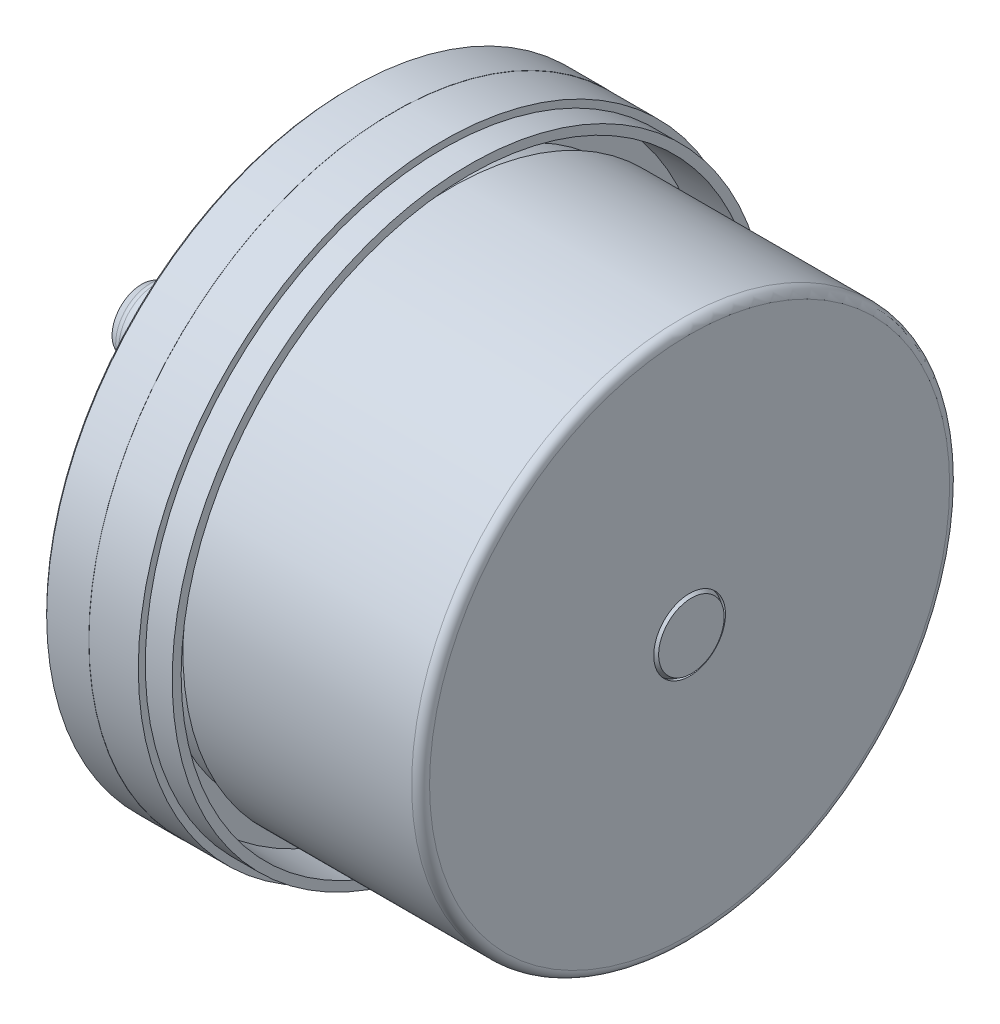
ISO-10303-21;
HEADER;
FILE_DESCRIPTION(('STEP AP214'),'2;1');
FILE_NAME('part.step','',(''),(''),'','','');
FILE_SCHEMA(('AUTOMOTIVE_DESIGN { 1 0 10303 214 1 1 1 1 }'));
ENDSEC;
DATA;
#1=APPLICATION_CONTEXT('core data for automotive mechanical design processes');
#2=APPLICATION_PROTOCOL_DEFINITION('international standard','automotive_design',2000,#1);
#3=PRODUCT_CONTEXT('',#1,'mechanical');
#4=PRODUCT('Part','Part','',(#3));
#5=PRODUCT_RELATED_PRODUCT_CATEGORY('part','',(#4));
#6=PRODUCT_DEFINITION_FORMATION('','',#4);
#7=PRODUCT_DEFINITION_CONTEXT('part definition',#1,'design');
#8=PRODUCT_DEFINITION('design','',#6,#7);
#9=PRODUCT_DEFINITION_SHAPE('','',#8);
#10=(LENGTH_UNIT() NAMED_UNIT(*) SI_UNIT(.MILLI.,.METRE.));
#11=(NAMED_UNIT(*) PLANE_ANGLE_UNIT() SI_UNIT($,.RADIAN.));
#12=(NAMED_UNIT(*) SI_UNIT($,.STERADIAN.) SOLID_ANGLE_UNIT());
#13=UNCERTAINTY_MEASURE_WITH_UNIT(LENGTH_MEASURE(1.E-05),#10,'distance_accuracy_value','');
#14=(GEOMETRIC_REPRESENTATION_CONTEXT(3) GLOBAL_UNCERTAINTY_ASSIGNED_CONTEXT((#13)) GLOBAL_UNIT_ASSIGNED_CONTEXT((#10,
#11,#12)) REPRESENTATION_CONTEXT('',''));
#15=CARTESIAN_POINT('',(0.,0.,0.));
#16=DIRECTION('',(0.,0.,1.));
#17=DIRECTION('',(1.,0.,0.));
#18=AXIS2_PLACEMENT_3D('',#15,#16,#17);
#19=CARTESIAN_POINT('',(-21.8999999999602,-8.96647078790032E-12,0.));
#20=DIRECTION('',(1.,0.,0.));
#21=DIRECTION('',(0.,0.,-1.));
#22=AXIS2_PLACEMENT_3D('',#19,#20,#21);
#23=CONICAL_SURFACE('',#22,4.00000000000897,0.523598775598299);
#24=CARTESIAN_POINT('',(-22.1320508075291,-8.96647078790032E-12,0.));
#25=DIRECTION('',(-1.,0.,0.));
#26=DIRECTION('',(0.,0.,1.));
#27=AXIS2_PLACEMENT_3D('',#24,#25,#26);
#28=CIRCLE('',#27,3.86602540379341);
#29=CARTESIAN_POINT('',(-22.1320508075291,-8.96647078790032E-12,3.86602540379341));
#30=VERTEX_POINT('',#29);
#31=EDGE_CURVE('E11',#30,#30,#28,.T.);
#32=ORIENTED_EDGE('',*,*,#31,.T.);
#33=EDGE_LOOP('',(#32));
#34=FACE_BOUND('',#33,.T.);
#35=CARTESIAN_POINT('',(-23.0999999999374,-8.96647078790032E-12,0.));
#36=DIRECTION('',(1.,0.,0.));
#37=DIRECTION('',(0.,0.,-1.));
#38=AXIS2_PLACEMENT_3D('',#35,#36,#37);
#39=CIRCLE('',#38,3.30717967699457);
#40=CARTESIAN_POINT('',(-23.0999999999374,-8.96647078790032E-12,-3.30717967699457));
#41=VERTEX_POINT('',#40);
#42=EDGE_CURVE('E121',#41,#41,#39,.T.);
#43=ORIENTED_EDGE('',*,*,#42,.T.);
#44=EDGE_LOOP('',(#43));
#45=FACE_BOUND('',#44,.T.);
#46=ADVANCED_FACE('F34',(#34,#45),#23,.T.);
#47=CARTESIAN_POINT('',(-23.0999999999374,3.3071796769856,0.));
#48=DIRECTION('',(-1.,0.,0.));
#49=DIRECTION('',(0.,0.,1.));
#50=AXIS2_PLACEMENT_3D('',#47,#48,#49);
#51=PLANE('',#50);
#52=ORIENTED_EDGE('',*,*,#42,.F.);
#53=EDGE_LOOP('',(#52));
#54=FACE_BOUND('',#53,.T.);
#55=ADVANCED_FACE('F175',(#54),#51,.T.);
#56=CARTESIAN_POINT('',(38.2000000000212,-8.96647078790032E-12,0.));
#57=DIRECTION('',(1.,0.,0.));
#58=DIRECTION('',(0.,0.,-1.));
#59=AXIS2_PLACEMENT_3D('',#56,#57,#58);
#60=PLANE('',#59);
#61=CARTESIAN_POINT('',(38.2000000000212,-8.96647078790032E-12,0.));
#62=DIRECTION('',(1.,0.,0.));
#63=DIRECTION('',(0.,0.,-1.));
#64=AXIS2_PLACEMENT_3D('',#61,#62,#63);
#65=CIRCLE('',#64,3.65358983848293);
#66=CARTESIAN_POINT('',(38.2000000000212,-8.96647078790032E-12,-3.65358983848293));
#67=VERTEX_POINT('',#66);
#68=EDGE_CURVE('E118',#67,#67,#65,.T.);
#69=ORIENTED_EDGE('',*,*,#68,.T.);
#70=EDGE_LOOP('',(#69));
#71=FACE_BOUND('',#70,.T.);
#72=ADVANCED_FACE('F181',(#71),#60,.T.);
#73=CARTESIAN_POINT('',(38.2000000000212,-8.96647078790032E-12,0.));
#74=DIRECTION('',(-1.,0.,0.));
#75=DIRECTION('',(0.,0.,1.));
#76=AXIS2_PLACEMENT_3D('',#73,#74,#75);
#77=CONICAL_SURFACE('',#76,3.65358983848293,0.52359877559829);
#78=CARTESIAN_POINT('',(37.6,-8.96647078790032E-12,0.));
#79=DIRECTION('',(1.,0.,0.));
#80=DIRECTION('',(0.,0.,-1.));
#81=AXIS2_PLACEMENT_3D('',#78,#79,#80);
#82=CIRCLE('',#81,4.00000000000897);
#83=CARTESIAN_POINT('',(37.6,-8.96647078790032E-12,-4.00000000000897));
#84=VERTEX_POINT('',#83);
#85=EDGE_CURVE('E115',#84,#84,#82,.T.);
#86=ORIENTED_EDGE('',*,*,#85,.T.);
#87=EDGE_LOOP('',(#86));
#88=FACE_BOUND('',#87,.T.);
#89=ORIENTED_EDGE('',*,*,#68,.F.);
#90=EDGE_LOOP('',(#89));
#91=FACE_BOUND('',#90,.T.);
#92=ADVANCED_FACE('F283',(#88,#91),#77,.T.);
#93=CARTESIAN_POINT('',(-23.0999999999374,-8.96647078790032E-12,0.));
#94=DIRECTION('',(1.,0.,0.));
#95=DIRECTION('',(0.,0.,-1.));
#96=AXIS2_PLACEMENT_3D('',#93,#94,#95);
#97=CYLINDRICAL_SURFACE('',#96,4.00000000000897);
#98=CARTESIAN_POINT('',(38.,-8.96647078790032E-12,0.));
#99=DIRECTION('',(1.,0.,0.));
#100=DIRECTION('',(0.,0.,-1.));
#101=AXIS2_PLACEMENT_3D('',#98,#99,#100);
#102=CIRCLE('',#101,4.00000000000897);
#103=CARTESIAN_POINT('',(38.,-8.96647078790032E-12,-4.00000000000897));
#104=VERTEX_POINT('',#103);
#105=EDGE_CURVE('E112',#104,#104,#102,.T.);
#106=ORIENTED_EDGE('',*,*,#105,.T.);
#107=EDGE_LOOP('',(#106));
#108=FACE_BOUND('',#107,.T.);
#109=ORIENTED_EDGE('',*,*,#85,.F.);
#110=EDGE_LOOP('',(#109));
#111=FACE_BOUND('',#110,.T.);
#112=ADVANCED_FACE('F279',(#108,#111),#97,.F.);
#113=CARTESIAN_POINT('',(38.,4.,0.));
#114=DIRECTION('',(1.,0.,0.));
#115=DIRECTION('',(0.,0.,-1.));
#116=AXIS2_PLACEMENT_3D('',#113,#114,#115);
#117=PLANE('',#116);
#118=CARTESIAN_POINT('',(38.,-8.96647078790032E-12,0.));
#119=DIRECTION('',(1.,0.,0.));
#120=DIRECTION('',(0.,0.,-1.));
#121=AXIS2_PLACEMENT_3D('',#118,#119,#120);
#122=CIRCLE('',#121,29.000000000007);
#123=CARTESIAN_POINT('',(38.,-8.96647078790032E-12,-29.000000000007));
#124=VERTEX_POINT('',#123);
#125=EDGE_CURVE('E154',#124,#124,#122,.T.);
#126=ORIENTED_EDGE('',*,*,#125,.T.);
#127=EDGE_LOOP('',(#126));
#128=FACE_BOUND('',#127,.T.);
#129=ORIENTED_EDGE('',*,*,#105,.F.);
#130=EDGE_LOOP('',(#129));
#131=FACE_BOUND('',#130,.T.);
#132=ADVANCED_FACE('F275',(#128,#131),#117,.T.);
#133=CARTESIAN_POINT('',(-23.0999999999374,-8.96647078790032E-12,0.));
#134=DIRECTION('',(1.,0.,0.));
#135=DIRECTION('',(0.,0.,-1.));
#136=AXIS2_PLACEMENT_3D('',#133,#134,#135);
#137=CYLINDRICAL_SURFACE('',#136,30.000000000007);
#138=CARTESIAN_POINT('',(37.,-8.96647078790032E-12,0.));
#139=DIRECTION('',(1.,0.,0.));
#140=DIRECTION('',(0.,0.,-1.));
#141=AXIS2_PLACEMENT_3D('',#138,#139,#140);
#142=CIRCLE('',#141,30.000000000007);
#143=CARTESIAN_POINT('',(37.,-8.96647078790032E-12,-30.000000000007));
#144=VERTEX_POINT('',#143);
#145=EDGE_CURVE('E157',#144,#144,#142,.F.);
#146=ORIENTED_EDGE('',*,*,#145,.T.);
#147=EDGE_LOOP('',(#146));
#148=FACE_BOUND('',#147,.T.);
#149=CARTESIAN_POINT('',(11.5000000000033,-8.96647078790032E-12,0.));
#150=DIRECTION('',(1.,0.,0.));
#151=DIRECTION('',(0.,0.,-1.));
#152=AXIS2_PLACEMENT_3D('',#149,#150,#151);
#153=CIRCLE('',#152,30.000000000007);
#154=CARTESIAN_POINT('',(11.5000000000033,-8.96647078790032E-12,-30.000000000007));
#155=VERTEX_POINT('',#154);
#156=EDGE_CURVE('E109',#155,#155,#153,.T.);
#157=ORIENTED_EDGE('',*,*,#156,.T.);
#158=EDGE_LOOP('',(#157));
#159=FACE_BOUND('',#158,.T.);
#160=ADVANCED_FACE('F271',(#148,#159),#137,.T.);
#161=CARTESIAN_POINT('',(11.5000000000033,29.9999999999981,0.));
#162=DIRECTION('',(-1.,0.,0.));
#163=DIRECTION('',(0.,0.,1.));
#164=AXIS2_PLACEMENT_3D('',#161,#162,#163);
#165=PLANE('',#164);
#166=CARTESIAN_POINT('',(11.5000000000033,-8.96647078790032E-12,0.));
#167=DIRECTION('',(1.,0.,0.));
#168=DIRECTION('',(0.,0.,-1.));
#169=AXIS2_PLACEMENT_3D('',#166,#167,#168);
#170=CIRCLE('',#169,29.000000000007);
#171=CARTESIAN_POINT('',(11.5000000000033,-8.96647078790032E-12,-29.000000000007));
#172=VERTEX_POINT('',#171);
#173=EDGE_CURVE('E106',#172,#172,#170,.T.);
#174=ORIENTED_EDGE('',*,*,#173,.T.);
#175=EDGE_LOOP('',(#174));
#176=FACE_BOUND('',#175,.T.);
#177=ORIENTED_EDGE('',*,*,#156,.F.);
#178=EDGE_LOOP('',(#177));
#179=FACE_BOUND('',#178,.T.);
#180=ADVANCED_FACE('F267',(#176,#179),#165,.T.);
#181=CARTESIAN_POINT('',(-23.0999999999374,-8.96647078790032E-12,0.));
#182=DIRECTION('',(1.,0.,0.));
#183=DIRECTION('',(0.,0.,-1.));
#184=AXIS2_PLACEMENT_3D('',#181,#182,#183);
#185=CYLINDRICAL_SURFACE('',#184,29.000000000007);
#186=CARTESIAN_POINT('',(7.80000000000329,-8.96647078790032E-12,0.));
#187=DIRECTION('',(1.,0.,0.));
#188=DIRECTION('',(0.,0.,-1.));
#189=AXIS2_PLACEMENT_3D('',#186,#187,#188);
#190=CIRCLE('',#189,29.000000000007);
#191=CARTESIAN_POINT('',(7.80000000000329,-8.96647078790032E-12,-29.000000000007));
#192=VERTEX_POINT('',#191);
#193=EDGE_CURVE('E103',#192,#192,#190,.T.);
#194=ORIENTED_EDGE('',*,*,#193,.T.);
#195=EDGE_LOOP('',(#194));
#196=FACE_BOUND('',#195,.T.);
#197=ORIENTED_EDGE('',*,*,#173,.F.);
#198=EDGE_LOOP('',(#197));
#199=FACE_BOUND('',#198,.T.);
#200=ADVANCED_FACE('F263',(#196,#199),#185,.T.);
#201=CARTESIAN_POINT('',(7.80000000000329,28.9999999999981,0.));
#202=DIRECTION('',(1.,0.,0.));
#203=DIRECTION('',(0.,0.,-1.));
#204=AXIS2_PLACEMENT_3D('',#201,#202,#203);
#205=PLANE('',#204);
#206=CARTESIAN_POINT('',(7.80000000000329,-8.96647078790032E-12,0.));
#207=DIRECTION('',(1.,0.,0.));
#208=DIRECTION('',(0.,0.,-1.));
#209=AXIS2_PLACEMENT_3D('',#206,#207,#208);
#210=CIRCLE('',#209,32.0009516139056);
#211=CARTESIAN_POINT('',(7.80000000000329,-8.96647078790032E-12,-32.0009516139056));
#212=VERTEX_POINT('',#211);
#213=EDGE_CURVE('E100',#212,#212,#210,.T.);
#214=ORIENTED_EDGE('',*,*,#213,.T.);
#215=EDGE_LOOP('',(#214));
#216=FACE_BOUND('',#215,.T.);
#217=ORIENTED_EDGE('',*,*,#193,.F.);
#218=EDGE_LOOP('',(#217));
#219=FACE_BOUND('',#218,.T.);
#220=ADVANCED_FACE('F259',(#216,#219),#205,.T.);
#221=CARTESIAN_POINT('',(7.80000000000329,-8.96647078790032E-12,0.));
#222=DIRECTION('',(1.,0.,0.));
#223=DIRECTION('',(0.,0.,-1.));
#224=AXIS2_PLACEMENT_3D('',#221,#222,#223);
#225=CONICAL_SURFACE('',#224,32.0009516139056,0.0349065850398798);
#226=CARTESIAN_POINT('',(13.5000000000032,-8.96647078790032E-12,0.));
#227=DIRECTION('',(1.,0.,0.));
#228=DIRECTION('',(0.,0.,-1.));
#229=AXIS2_PLACEMENT_3D('',#226,#227,#228);
#230=CIRCLE('',#229,32.2000000000085);
#231=CARTESIAN_POINT('',(13.5000000000032,-8.96647078790032E-12,-32.2000000000085));
#232=VERTEX_POINT('',#231);
#233=EDGE_CURVE('E97',#232,#232,#230,.T.);
#234=ORIENTED_EDGE('',*,*,#233,.T.);
#235=EDGE_LOOP('',(#234));
#236=FACE_BOUND('',#235,.T.);
#237=ORIENTED_EDGE('',*,*,#213,.F.);
#238=EDGE_LOOP('',(#237));
#239=FACE_BOUND('',#238,.T.);
#240=ADVANCED_FACE('F255',(#236,#239),#225,.F.);
#241=CARTESIAN_POINT('',(13.5000000000032,32.1999999999995,0.));
#242=DIRECTION('',(1.,0.,0.));
#243=DIRECTION('',(0.,0.,-1.));
#244=AXIS2_PLACEMENT_3D('',#241,#242,#243);
#245=PLANE('',#244);
#246=CARTESIAN_POINT('',(13.5000000000032,-8.96647078790032E-12,0.));
#247=DIRECTION('',(1.,0.,0.));
#248=DIRECTION('',(0.,0.,-1.));
#249=AXIS2_PLACEMENT_3D('',#246,#247,#248);
#250=CIRCLE('',#249,33.200000000007);
#251=CARTESIAN_POINT('',(13.5000000000032,-8.96647078790032E-12,-33.200000000007));
#252=VERTEX_POINT('',#251);
#253=EDGE_CURVE('E94',#252,#252,#250,.T.);
#254=ORIENTED_EDGE('',*,*,#253,.T.);
#255=EDGE_LOOP('',(#254));
#256=FACE_BOUND('',#255,.T.);
#257=ORIENTED_EDGE('',*,*,#233,.F.);
#258=EDGE_LOOP('',(#257));
#259=FACE_BOUND('',#258,.T.);
#260=ADVANCED_FACE('F251',(#256,#259),#245,.T.);
#261=CARTESIAN_POINT('',(-23.0999999999374,-8.96647078790032E-12,0.));
#262=DIRECTION('',(1.,0.,0.));
#263=DIRECTION('',(0.,0.,-1.));
#264=AXIS2_PLACEMENT_3D('',#261,#262,#263);
#265=CYLINDRICAL_SURFACE('',#264,33.200000000007);
#266=CARTESIAN_POINT('',(10.5000000000032,-8.96647078790032E-12,0.));
#267=DIRECTION('',(1.,0.,0.));
#268=DIRECTION('',(0.,0.,-1.));
#269=AXIS2_PLACEMENT_3D('',#266,#267,#268);
#270=CIRCLE('',#269,33.2000000000071);
#271=CARTESIAN_POINT('',(10.5000000000032,-8.96647078790032E-12,-33.2000000000071));
#272=VERTEX_POINT('',#271);
#273=EDGE_CURVE('E91',#272,#272,#270,.T.);
#274=ORIENTED_EDGE('',*,*,#273,.T.);
#275=EDGE_LOOP('',(#274));
#276=FACE_BOUND('',#275,.T.);
#277=ORIENTED_EDGE('',*,*,#253,.F.);
#278=EDGE_LOOP('',(#277));
#279=FACE_BOUND('',#278,.T.);
#280=ADVANCED_FACE('F247',(#276,#279),#265,.T.);
#281=CARTESIAN_POINT('',(10.5000000000032,33.1999999999981,0.));
#282=DIRECTION('',(1.,0.,0.));
#283=DIRECTION('',(0.,0.,-1.));
#284=AXIS2_PLACEMENT_3D('',#281,#282,#283);
#285=PLANE('',#284);
#286=CARTESIAN_POINT('',(10.5000000000032,-8.96647078790032E-12,0.));
#287=DIRECTION('',(1.,0.,0.));
#288=DIRECTION('',(0.,0.,-1.));
#289=AXIS2_PLACEMENT_3D('',#286,#287,#288);
#290=CIRCLE('',#289,33.980000000007);
#291=CARTESIAN_POINT('',(10.5000000000032,-8.96647078790032E-12,-33.980000000007));
#292=VERTEX_POINT('',#291);
#293=EDGE_CURVE('E88',#292,#292,#290,.T.);
#294=ORIENTED_EDGE('',*,*,#293,.T.);
#295=EDGE_LOOP('',(#294));
#296=FACE_BOUND('',#295,.T.);
#297=ORIENTED_EDGE('',*,*,#273,.F.);
#298=EDGE_LOOP('',(#297));
#299=FACE_BOUND('',#298,.T.);
#300=ADVANCED_FACE('F243',(#296,#299),#285,.T.);
#301=CARTESIAN_POINT('',(-23.0999999999374,-8.96647078790032E-12,0.));
#302=DIRECTION('',(1.,0.,0.));
#303=DIRECTION('',(0.,0.,-1.));
#304=AXIS2_PLACEMENT_3D('',#301,#302,#303);
#305=CYLINDRICAL_SURFACE('',#304,33.980000000007);
#306=CARTESIAN_POINT('',(5.00000000000322,-8.96647078790032E-12,0.));
#307=DIRECTION('',(1.,0.,0.));
#308=DIRECTION('',(0.,0.,-1.));
#309=AXIS2_PLACEMENT_3D('',#306,#307,#308);
#310=CIRCLE('',#309,33.980000000007);
#311=CARTESIAN_POINT('',(5.00000000000322,-8.96647078790032E-12,-33.980000000007));
#312=VERTEX_POINT('',#311);
#313=EDGE_CURVE('E85',#312,#312,#310,.T.);
#314=ORIENTED_EDGE('',*,*,#313,.T.);
#315=EDGE_LOOP('',(#314));
#316=FACE_BOUND('',#315,.T.);
#317=ORIENTED_EDGE('',*,*,#293,.F.);
#318=EDGE_LOOP('',(#317));
#319=FACE_BOUND('',#318,.T.);
#320=ADVANCED_FACE('F239',(#316,#319),#305,.T.);
#321=CARTESIAN_POINT('',(5.00000000000322,33.9799999999981,0.));
#322=DIRECTION('',(1.,0.,0.));
#323=DIRECTION('',(0.,0.,-1.));
#324=AXIS2_PLACEMENT_3D('',#321,#322,#323);
#325=PLANE('',#324);
#326=CARTESIAN_POINT('',(5.00000000000322,-8.96647078790032E-12,0.));
#327=DIRECTION('',(1.,0.,0.));
#328=DIRECTION('',(0.,0.,-1.));
#329=AXIS2_PLACEMENT_3D('',#326,#327,#328);
#330=CIRCLE('',#329,34.000000000007);
#331=CARTESIAN_POINT('',(5.00000000000322,-8.96647078790032E-12,-34.000000000007));
#332=VERTEX_POINT('',#331);
#333=EDGE_CURVE('E82',#332,#332,#330,.T.);
#334=ORIENTED_EDGE('',*,*,#333,.T.);
#335=EDGE_LOOP('',(#334));
#336=FACE_BOUND('',#335,.T.);
#337=ORIENTED_EDGE('',*,*,#313,.F.);
#338=EDGE_LOOP('',(#337));
#339=FACE_BOUND('',#338,.T.);
#340=ADVANCED_FACE('F232',(#336,#339),#325,.T.);
#341=CARTESIAN_POINT('',(-23.0999999999374,-8.96647078790032E-12,0.));
#342=DIRECTION('',(1.,0.,0.));
#343=DIRECTION('',(0.,0.,-1.));
#344=AXIS2_PLACEMENT_3D('',#341,#342,#343);
#345=CYLINDRICAL_SURFACE('',#344,34.000000000007);
#346=CARTESIAN_POINT('',(0.300000000003332,-8.96647078790032E-12,0.));
#347=DIRECTION('',(-1.,0.,0.));
#348=DIRECTION('',(0.,0.,1.));
#349=AXIS2_PLACEMENT_3D('',#346,#347,#348);
#350=CIRCLE('',#349,34.000000000007);
#351=CARTESIAN_POINT('',(0.300000000003332,-8.96647078790032E-12,34.000000000007));
#352=VERTEX_POINT('',#351);
#353=EDGE_CURVE('E142',#352,#352,#350,.F.);
#354=ORIENTED_EDGE('',*,*,#353,.T.);
#355=EDGE_LOOP('',(#354));
#356=FACE_BOUND('',#355,.T.);
#357=ORIENTED_EDGE('',*,*,#333,.F.);
#358=EDGE_LOOP('',(#357));
#359=FACE_BOUND('',#358,.T.);
#360=ADVANCED_FACE('F226',(#356,#359),#345,.T.);
#361=CARTESIAN_POINT('',(3.21835627661152E-12,33.9999999999981,0.));
#362=DIRECTION('',(-1.,0.,0.));
#363=DIRECTION('',(0.,0.,1.));
#364=AXIS2_PLACEMENT_3D('',#361,#362,#363);
#365=PLANE('',#364);
#366=CARTESIAN_POINT('',(3.21835627661152E-12,-8.96647078790032E-12,0.));
#367=DIRECTION('',(-1.,0.,0.));
#368=DIRECTION('',(0.,0.,1.));
#369=AXIS2_PLACEMENT_3D('',#366,#367,#368);
#370=CIRCLE('',#369,33.700000000007);
#371=CARTESIAN_POINT('',(3.21835627661152E-12,-8.96647078790032E-12,33.700000000007));
#372=VERTEX_POINT('',#371);
#373=EDGE_CURVE('E145',#372,#372,#370,.T.);
#374=ORIENTED_EDGE('',*,*,#373,.T.);
#375=EDGE_LOOP('',(#374));
#376=FACE_BOUND('',#375,.T.);
#377=CARTESIAN_POINT('',(3.21835627661152E-12,21.5,0.));
#378=DIRECTION('',(-1.,0.,0.));
#379=DIRECTION('',(0.,0.,1.));
#380=AXIS2_PLACEMENT_3D('',#377,#378,#379);
#381=CIRCLE('',#380,2.20000000009175);
#382=CARTESIAN_POINT('',(3.21835627661152E-12,21.5,2.20000000009175));
#383=VERTEX_POINT('',#382);
#384=EDGE_CURVE('E133',#383,#383,#381,.F.);
#385=ORIENTED_EDGE('',*,*,#384,.T.);
#386=EDGE_LOOP('',(#385));
#387=FACE_BOUND('',#386,.T.);
#388=CARTESIAN_POINT('',(3.21835627661152E-12,-10.75,18.61954618137));
#389=DIRECTION('',(-1.,0.,0.));
#390=DIRECTION('',(0.,0.,1.));
#391=AXIS2_PLACEMENT_3D('',#388,#389,#390);
#392=CIRCLE('',#391,2.20000000009175);
#393=CARTESIAN_POINT('',(3.21835627661152E-12,-10.75,20.8195461814618));
#394=VERTEX_POINT('',#393);
#395=EDGE_CURVE('E130',#394,#394,#392,.F.);
#396=ORIENTED_EDGE('',*,*,#395,.T.);
#397=EDGE_LOOP('',(#396));
#398=FACE_BOUND('',#397,.T.);
#399=CARTESIAN_POINT('',(3.21835627661152E-12,-10.75,-18.61954618137));
#400=DIRECTION('',(-1.,0.,0.));
#401=DIRECTION('',(0.,0.,1.));
#402=AXIS2_PLACEMENT_3D('',#399,#400,#401);
#403=CIRCLE('',#402,2.20000000009175);
#404=CARTESIAN_POINT('',(3.21835627661152E-12,-10.75,-16.4195461812782));
#405=VERTEX_POINT('',#404);
#406=EDGE_CURVE('E127',#405,#405,#403,.F.);
#407=ORIENTED_EDGE('',*,*,#406,.T.);
#408=EDGE_LOOP('',(#407));
#409=FACE_BOUND('',#408,.T.);
#410=CARTESIAN_POINT('',(3.21964677141295E-12,-8.96647078790032E-12,0.));
#411=DIRECTION('',(1.,0.,0.));
#412=DIRECTION('',(0.,0.,-1.));
#413=AXIS2_PLACEMENT_3D('',#410,#411,#412);
#414=CIRCLE('',#413,11.2886751346026);
#415=CARTESIAN_POINT('',(3.21964677141295E-12,-8.96647078790032E-12,-11.2886751346026));
#416=VERTEX_POINT('',#415);
#417=EDGE_CURVE('E79',#416,#416,#414,.T.);
#418=ORIENTED_EDGE('',*,*,#417,.T.);
#419=EDGE_LOOP('',(#418));
#420=FACE_BOUND('',#419,.T.);
#421=ADVANCED_FACE('F221',(#376,#387,#398,#409,#420),#365,.T.);
#422=CARTESIAN_POINT('',(3.21964677141295E-12,-8.96647078790032E-12,0.));
#423=DIRECTION('',(-1.,0.,0.));
#424=DIRECTION('',(0.,0.,1.));
#425=AXIS2_PLACEMENT_3D('',#422,#423,#424);
#426=CONICAL_SURFACE('',#425,11.2886751346026,0.523598775598298);
#427=CARTESIAN_POINT('',(0.500000000001138,-8.96647078790032E-12,0.));
#428=DIRECTION('',(1.,0.,0.));
#429=DIRECTION('',(0.,0.,-1.));
#430=AXIS2_PLACEMENT_3D('',#427,#428,#429);
#431=CIRCLE('',#430,11.000000000009);
#432=CARTESIAN_POINT('',(0.500000000001138,-8.96647078790032E-12,-11.000000000009));
#433=VERTEX_POINT('',#432);
#434=EDGE_CURVE('E76',#433,#433,#431,.T.);
#435=ORIENTED_EDGE('',*,*,#434,.T.);
#436=EDGE_LOOP('',(#435));
#437=FACE_BOUND('',#436,.T.);
#438=ORIENTED_EDGE('',*,*,#417,.F.);
#439=EDGE_LOOP('',(#438));
#440=FACE_BOUND('',#439,.T.);
#441=ADVANCED_FACE('F215',(#437,#440),#426,.F.);
#442=CARTESIAN_POINT('',(-23.0999999999374,-8.96647078790032E-12,0.));
#443=DIRECTION('',(1.,0.,0.));
#444=DIRECTION('',(0.,0.,-1.));
#445=AXIS2_PLACEMENT_3D('',#442,#443,#444);
#446=CYLINDRICAL_SURFACE('',#445,11.000000000009);
#447=CARTESIAN_POINT('',(-2.1,-8.96647078790032E-12,0.));
#448=DIRECTION('',(-1.,0.,0.));
#449=DIRECTION('',(0.,0.,1.));
#450=AXIS2_PLACEMENT_3D('',#447,#448,#449);
#451=CIRCLE('',#450,11.000000000009);
#452=CARTESIAN_POINT('',(-2.1,-8.96647078790032E-12,11.000000000009));
#453=VERTEX_POINT('',#452);
#454=EDGE_CURVE('E148',#453,#453,#451,.F.);
#455=ORIENTED_EDGE('',*,*,#454,.T.);
#456=EDGE_LOOP('',(#455));
#457=FACE_BOUND('',#456,.T.);
#458=ORIENTED_EDGE('',*,*,#434,.F.);
#459=EDGE_LOOP('',(#458));
#460=FACE_BOUND('',#459,.T.);
#461=ADVANCED_FACE('F211',(#457,#460),#446,.T.);
#462=CARTESIAN_POINT('',(-2.6,11.,0.));
#463=DIRECTION('',(-1.,0.,0.));
#464=DIRECTION('',(0.,0.,1.));
#465=AXIS2_PLACEMENT_3D('',#462,#463,#464);
#466=PLANE('',#465);
#467=CARTESIAN_POINT('',(-2.6,-8.96647078790032E-12,0.));
#468=DIRECTION('',(-1.,0.,0.));
#469=DIRECTION('',(0.,0.,1.));
#470=AXIS2_PLACEMENT_3D('',#467,#468,#469);
#471=CIRCLE('',#470,10.500000000009);
#472=CARTESIAN_POINT('',(-2.6,-8.96647078790032E-12,10.500000000009));
#473=VERTEX_POINT('',#472);
#474=EDGE_CURVE('E151',#473,#473,#471,.T.);
#475=ORIENTED_EDGE('',*,*,#474,.T.);
#476=EDGE_LOOP('',(#475));
#477=FACE_BOUND('',#476,.T.);
#478=CARTESIAN_POINT('',(-2.6,-8.96647078790032E-12,0.));
#479=DIRECTION('',(1.,0.,0.));
#480=DIRECTION('',(0.,0.,-1.));
#481=AXIS2_PLACEMENT_3D('',#478,#479,#480);
#482=CIRCLE('',#481,4.50000000000897);
#483=CARTESIAN_POINT('',(-2.6,-8.96647078790032E-12,-4.50000000000897));
#484=VERTEX_POINT('',#483);
#485=EDGE_CURVE('E73',#484,#484,#482,.T.);
#486=ORIENTED_EDGE('',*,*,#485,.T.);
#487=EDGE_LOOP('',(#486));
#488=FACE_BOUND('',#487,.T.);
#489=ADVANCED_FACE('F214',(#477,#488),#466,.T.);
#490=CARTESIAN_POINT('',(-2.1,-8.96678564732412E-12,0.));
#491=DIRECTION('',(1.,0.,0.));
#492=DIRECTION('',(0.,0.,-1.));
#493=AXIS2_PLACEMENT_3D('',#490,#491,#492);
#494=TOROIDAL_SURFACE('',#493,4.50000000000897,0.5);
#495=CARTESIAN_POINT('',(-2.1,-8.96647078790032E-12,0.));
#496=DIRECTION('',(1.,0.,0.));
#497=DIRECTION('',(0.,0.,-1.));
#498=AXIS2_PLACEMENT_3D('',#495,#496,#497);
#499=CIRCLE('',#498,4.00000000000897);
#500=CARTESIAN_POINT('',(-2.1,-8.96647078790032E-12,-4.00000000000897));
#501=VERTEX_POINT('',#500);
#502=EDGE_CURVE('E70',#501,#501,#499,.T.);
#503=ORIENTED_EDGE('',*,*,#502,.T.);
#504=EDGE_LOOP('',(#503));
#505=FACE_BOUND('',#504,.T.);
#506=ORIENTED_EDGE('',*,*,#485,.F.);
#507=EDGE_LOOP('',(#506));
#508=FACE_BOUND('',#507,.T.);
#509=ADVANCED_FACE('F383',(#505,#508),#494,.T.);
#510=CARTESIAN_POINT('',(-23.0999999999374,-8.96647078790032E-12,0.));
#511=DIRECTION('',(1.,0.,0.));
#512=DIRECTION('',(0.,0.,-1.));
#513=AXIS2_PLACEMENT_3D('',#510,#511,#512);
#514=CYLINDRICAL_SURFACE('',#513,4.00000000000897);
#515=CARTESIAN_POINT('',(-21.6320508075291,-8.96647078790032E-12,0.));
#516=DIRECTION('',(-1.,0.,0.));
#517=DIRECTION('',(0.,0.,1.));
#518=AXIS2_PLACEMENT_3D('',#515,#516,#517);
#519=CIRCLE('',#518,4.00000000000897);
#520=CARTESIAN_POINT('',(-21.6320508075291,-8.96647078790032E-12,4.00000000000897));
#521=VERTEX_POINT('',#520);
#522=EDGE_CURVE('E42',#521,#521,#519,.F.);
#523=ORIENTED_EDGE('',*,*,#522,.T.);
#524=EDGE_LOOP('',(#523));
#525=FACE_BOUND('',#524,.T.);
#526=ORIENTED_EDGE('',*,*,#502,.F.);
#527=EDGE_LOOP('',(#526));
#528=FACE_BOUND('',#527,.T.);
#529=ADVANCED_FACE('F162',(#525,#528),#514,.T.);
#530=CARTESIAN_POINT('',(7.3,-10.75,-18.61954618137));
#531=DIRECTION('',(-1.,0.,0.));
#532=DIRECTION('',(0.,0.,1.));
#533=AXIS2_PLACEMENT_3D('',#530,#531,#532);
#534=CONICAL_SURFACE('',#533,1.64999999999999,1.02974425866086);
#535=CARTESIAN_POINT('',(8.29142002143094,-10.75,-18.61954618137));
#536=VERTEX_POINT('',#535);
#537=VERTEX_LOOP('',#536);
#538=FACE_BOUND('',#537,.T.);
#539=CARTESIAN_POINT('',(7.3,-10.75,-18.61954618137));
#540=DIRECTION('',(-1.,0.,0.));
#541=DIRECTION('',(0.,0.,1.));
#542=AXIS2_PLACEMENT_3D('',#539,#540,#541);
#543=CIRCLE('',#542,1.64999999999999);
#544=CARTESIAN_POINT('',(7.3,-10.75,-16.96954618137));
#545=VERTEX_POINT('',#544);
#546=EDGE_CURVE('E65',#545,#545,#543,.T.);
#547=ORIENTED_EDGE('',*,*,#546,.T.);
#548=EDGE_LOOP('',(#547));
#549=FACE_BOUND('',#548,.T.);
#550=ADVANCED_FACE('F443',(#538,#549),#534,.F.);
#551=CARTESIAN_POINT('',(0.,-10.75,-18.61954618137));
#552=DIRECTION('',(-1.,0.,0.));
#553=DIRECTION('',(0.,0.,1.));
#554=AXIS2_PLACEMENT_3D('',#551,#552,#553);
#555=CYLINDRICAL_SURFACE('',#554,1.64999999999999);
#556=CARTESIAN_POINT('',(0.550000000076143,-10.75,-18.61954618137));
#557=DIRECTION('',(-1.,0.,0.));
#558=DIRECTION('',(0.,0.,1.));
#559=AXIS2_PLACEMENT_3D('',#556,#557,#558);
#560=CIRCLE('',#559,1.64999999999999);
#561=CARTESIAN_POINT('',(0.550000000076143,-10.75,-16.96954618137));
#562=VERTEX_POINT('',#561);
#563=EDGE_CURVE('E139',#562,#562,#560,.T.);
#564=ORIENTED_EDGE('',*,*,#563,.T.);
#565=EDGE_LOOP('',(#564));
#566=FACE_BOUND('',#565,.T.);
#567=ORIENTED_EDGE('',*,*,#546,.F.);
#568=EDGE_LOOP('',(#567));
#569=FACE_BOUND('',#568,.T.);
#570=ADVANCED_FACE('F455',(#566,#569),#555,.F.);
#571=CARTESIAN_POINT('',(7.3,-10.75,18.61954618137));
#572=DIRECTION('',(-1.,0.,0.));
#573=DIRECTION('',(0.,0.,1.));
#574=AXIS2_PLACEMENT_3D('',#571,#572,#573);
#575=CONICAL_SURFACE('',#574,1.64999999999999,1.02974425866086);
#576=CARTESIAN_POINT('',(8.29142002143094,-10.75,18.61954618137));
#577=VERTEX_POINT('',#576);
#578=VERTEX_LOOP('',#577);
#579=FACE_BOUND('',#578,.T.);
#580=CARTESIAN_POINT('',(7.3,-10.75,18.61954618137));
#581=DIRECTION('',(-1.,0.,0.));
#582=DIRECTION('',(0.,0.,1.));
#583=AXIS2_PLACEMENT_3D('',#580,#581,#582);
#584=CIRCLE('',#583,1.64999999999999);
#585=CARTESIAN_POINT('',(7.3,-10.75,20.26954618137));
#586=VERTEX_POINT('',#585);
#587=EDGE_CURVE('E62',#586,#586,#584,.T.);
#588=ORIENTED_EDGE('',*,*,#587,.T.);
#589=EDGE_LOOP('',(#588));
#590=FACE_BOUND('',#589,.T.);
#591=ADVANCED_FACE('F462',(#579,#590),#575,.F.);
#592=CARTESIAN_POINT('',(0.,-10.75,18.61954618137));
#593=DIRECTION('',(-1.,0.,0.));
#594=DIRECTION('',(0.,0.,1.));
#595=AXIS2_PLACEMENT_3D('',#592,#593,#594);
#596=CYLINDRICAL_SURFACE('',#595,1.64999999999999);
#597=CARTESIAN_POINT('',(0.550000000076143,-10.75,18.61954618137));
#598=DIRECTION('',(-1.,0.,0.));
#599=DIRECTION('',(0.,0.,1.));
#600=AXIS2_PLACEMENT_3D('',#597,#598,#599);
#601=CIRCLE('',#600,1.64999999999999);
#602=CARTESIAN_POINT('',(0.550000000076143,-10.75,20.26954618137));
#603=VERTEX_POINT('',#602);
#604=EDGE_CURVE('E136',#603,#603,#601,.T.);
#605=ORIENTED_EDGE('',*,*,#604,.T.);
#606=EDGE_LOOP('',(#605));
#607=FACE_BOUND('',#606,.T.);
#608=ORIENTED_EDGE('',*,*,#587,.F.);
#609=EDGE_LOOP('',(#608));
#610=FACE_BOUND('',#609,.T.);
#611=ADVANCED_FACE('F56',(#607,#610),#596,.F.);
#612=CARTESIAN_POINT('',(7.3,21.5,0.));
#613=DIRECTION('',(-1.,0.,0.));
#614=DIRECTION('',(0.,0.,1.));
#615=AXIS2_PLACEMENT_3D('',#612,#613,#614);
#616=CONICAL_SURFACE('',#615,1.64999999999999,1.02974425866086);
#617=CARTESIAN_POINT('',(8.29142002143094,21.5,0.));
#618=VERTEX_POINT('',#617);
#619=VERTEX_LOOP('',#618);
#620=FACE_BOUND('',#619,.T.);
#621=CARTESIAN_POINT('',(7.3,21.5,0.));
#622=DIRECTION('',(-1.,0.,0.));
#623=DIRECTION('',(0.,0.,1.));
#624=AXIS2_PLACEMENT_3D('',#621,#622,#623);
#625=CIRCLE('',#624,1.64999999999999);
#626=CARTESIAN_POINT('',(7.3,21.5,1.64999999999999));
#627=VERTEX_POINT('',#626);
#628=EDGE_CURVE('E60',#627,#627,#625,.T.);
#629=ORIENTED_EDGE('',*,*,#628,.T.);
#630=EDGE_LOOP('',(#629));
#631=FACE_BOUND('',#630,.T.);
#632=ADVANCED_FACE('F52',(#620,#631),#616,.F.);
#633=CARTESIAN_POINT('',(0.,21.5,0.));
#634=DIRECTION('',(-1.,0.,0.));
#635=DIRECTION('',(0.,0.,1.));
#636=AXIS2_PLACEMENT_3D('',#633,#634,#635);
#637=CYLINDRICAL_SURFACE('',#636,1.64999999999999);
#638=CARTESIAN_POINT('',(0.550000000076144,21.5,0.));
#639=DIRECTION('',(-1.,0.,0.));
#640=DIRECTION('',(0.,0.,1.));
#641=AXIS2_PLACEMENT_3D('',#638,#639,#640);
#642=CIRCLE('',#641,1.64999999999999);
#643=CARTESIAN_POINT('',(0.550000000076144,21.5,1.64999999999999));
#644=VERTEX_POINT('',#643);
#645=EDGE_CURVE('E124',#644,#644,#642,.T.);
#646=ORIENTED_EDGE('',*,*,#645,.T.);
#647=EDGE_LOOP('',(#646));
#648=FACE_BOUND('',#647,.T.);
#649=ORIENTED_EDGE('',*,*,#628,.F.);
#650=EDGE_LOOP('',(#649));
#651=FACE_BOUND('',#650,.T.);
#652=ADVANCED_FACE('F55',(#648,#651),#637,.F.);
#653=CARTESIAN_POINT('',(0.550000000076144,21.5,0.));
#654=DIRECTION('',(-1.,0.,0.));
#655=DIRECTION('',(0.,0.,1.));
#656=AXIS2_PLACEMENT_3D('',#653,#654,#655);
#657=CONICAL_SURFACE('',#656,1.64999999999999,0.785398163414575);
#658=ORIENTED_EDGE('',*,*,#384,.F.);
#659=EDGE_LOOP('',(#658));
#660=FACE_BOUND('',#659,.T.);
#661=ORIENTED_EDGE('',*,*,#645,.F.);
#662=EDGE_LOOP('',(#661));
#663=FACE_BOUND('',#662,.T.);
#664=ADVANCED_FACE('F187',(#660,#663),#657,.F.);
#665=CARTESIAN_POINT('',(0.550000000076143,-10.75,18.61954618137));
#666=DIRECTION('',(-1.,0.,0.));
#667=DIRECTION('',(0.,0.,1.));
#668=AXIS2_PLACEMENT_3D('',#665,#666,#667);
#669=CONICAL_SURFACE('',#668,1.64999999999999,0.785398163414575);
#670=ORIENTED_EDGE('',*,*,#395,.F.);
#671=EDGE_LOOP('',(#670));
#672=FACE_BOUND('',#671,.T.);
#673=ORIENTED_EDGE('',*,*,#604,.F.);
#674=EDGE_LOOP('',(#673));
#675=FACE_BOUND('',#674,.T.);
#676=ADVANCED_FACE('F190',(#672,#675),#669,.F.);
#677=CARTESIAN_POINT('',(0.550000000076143,-10.75,-18.61954618137));
#678=DIRECTION('',(-1.,0.,0.));
#679=DIRECTION('',(0.,0.,1.));
#680=AXIS2_PLACEMENT_3D('',#677,#678,#679);
#681=CONICAL_SURFACE('',#680,1.64999999999999,0.785398163414575);
#682=ORIENTED_EDGE('',*,*,#406,.F.);
#683=EDGE_LOOP('',(#682));
#684=FACE_BOUND('',#683,.T.);
#685=ORIENTED_EDGE('',*,*,#563,.F.);
#686=EDGE_LOOP('',(#685));
#687=FACE_BOUND('',#686,.T.);
#688=ADVANCED_FACE('F194',(#684,#687),#681,.F.);
#689=CARTESIAN_POINT('',(0.300000000003332,-8.96647078790032E-12,0.));
#690=DIRECTION('',(1.,0.,0.));
#691=DIRECTION('',(0.,0.,-1.));
#692=AXIS2_PLACEMENT_3D('',#689,#690,#691);
#693=CONICAL_SURFACE('',#692,34.000000000007,0.785398163397298);
#694=ORIENTED_EDGE('',*,*,#373,.F.);
#695=EDGE_LOOP('',(#694));
#696=FACE_BOUND('',#695,.T.);
#697=ORIENTED_EDGE('',*,*,#353,.F.);
#698=EDGE_LOOP('',(#697));
#699=FACE_BOUND('',#698,.T.);
#700=ADVANCED_FACE('F198',(#696,#699),#693,.T.);
#701=CARTESIAN_POINT('',(-2.1,-8.96647078790032E-12,0.));
#702=DIRECTION('',(-1.,0.,0.));
#703=DIRECTION('',(0.,0.,1.));
#704=AXIS2_PLACEMENT_3D('',#701,#702,#703);
#705=TOROIDAL_SURFACE('',#704,10.500000000009,0.5);
#706=ORIENTED_EDGE('',*,*,#474,.F.);
#707=EDGE_LOOP('',(#706));
#708=FACE_BOUND('',#707,.T.);
#709=ORIENTED_EDGE('',*,*,#454,.F.);
#710=EDGE_LOOP('',(#709));
#711=FACE_BOUND('',#710,.T.);
#712=ADVANCED_FACE('F171',(#708,#711),#705,.T.);
#713=CARTESIAN_POINT('',(37.,-8.96647078790032E-12,0.));
#714=DIRECTION('',(1.,0.,0.));
#715=DIRECTION('',(0.,0.,-1.));
#716=AXIS2_PLACEMENT_3D('',#713,#714,#715);
#717=TOROIDAL_SURFACE('',#716,29.000000000007,1.);
#718=ORIENTED_EDGE('',*,*,#145,.F.);
#719=EDGE_LOOP('',(#718));
#720=FACE_BOUND('',#719,.T.);
#721=ORIENTED_EDGE('',*,*,#125,.F.);
#722=EDGE_LOOP('',(#721));
#723=FACE_BOUND('',#722,.T.);
#724=ADVANCED_FACE('F166',(#720,#723),#717,.T.);
#725=CARTESIAN_POINT('',(-21.6320508075291,-8.96647078790032E-12,0.));
#726=DIRECTION('',(-1.,0.,0.));
#727=DIRECTION('',(0.,0.,1.));
#728=AXIS2_PLACEMENT_3D('',#725,#726,#727);
#729=TOROIDAL_SURFACE('',#728,3.00000000000897,1.);
#730=ORIENTED_EDGE('',*,*,#31,.F.);
#731=EDGE_LOOP('',(#730));
#732=FACE_BOUND('',#731,.T.);
#733=ORIENTED_EDGE('',*,*,#522,.F.);
#734=EDGE_LOOP('',(#733));
#735=FACE_BOUND('',#734,.T.);
#736=ADVANCED_FACE('F36',(#732,#735),#729,.T.);
#737=CLOSED_SHELL('',(#46,#55,#72,#92,#112,#132,#160,#180,#200,#220,#240,#260,#280,#300,#320,
#340,#360,#421,#441,#461,#489,#509,#529,#550,#570,#591,#611,#632,#652,#664,#676,#688,#700,#712,
#724,#736));
#738=MANIFOLD_SOLID_BREP('B2',#737);
#739=ADVANCED_BREP_SHAPE_REPRESENTATION('',(#18,#738),#14);
#740=SHAPE_DEFINITION_REPRESENTATION(#9,#739);
ENDSEC;
END-ISO-10303-21;
